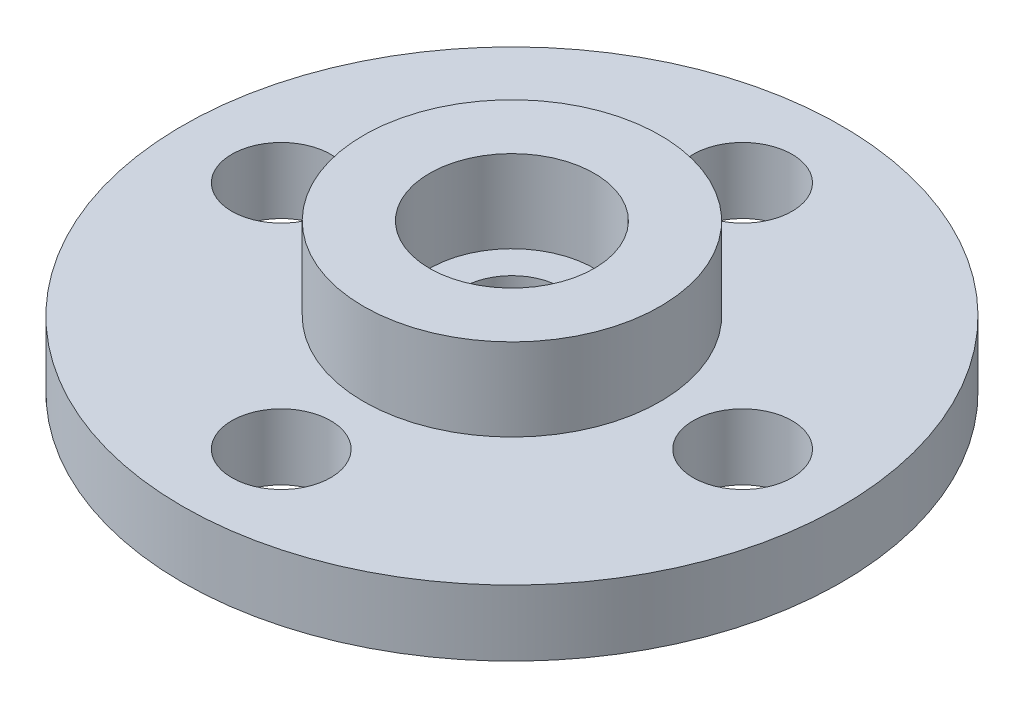
ISO-10303-21;
HEADER;
FILE_DESCRIPTION(('STEP AP214'),'2;1');
FILE_NAME('part.step','',(''),(''),'','','');
FILE_SCHEMA(('AUTOMOTIVE_DESIGN { 1 0 10303 214 1 1 1 1 }'));
ENDSEC;
DATA;
#1=APPLICATION_CONTEXT('core data for automotive mechanical design processes');
#2=APPLICATION_PROTOCOL_DEFINITION('international standard','automotive_design',2000,#1);
#3=PRODUCT_CONTEXT('',#1,'mechanical');
#4=PRODUCT('Part','Part','',(#3));
#5=PRODUCT_RELATED_PRODUCT_CATEGORY('part','',(#4));
#6=PRODUCT_DEFINITION_FORMATION('','',#4);
#7=PRODUCT_DEFINITION_CONTEXT('part definition',#1,'design');
#8=PRODUCT_DEFINITION('design','',#6,#7);
#9=PRODUCT_DEFINITION_SHAPE('','',#8);
#10=(LENGTH_UNIT() NAMED_UNIT(*) SI_UNIT(.MILLI.,.METRE.));
#11=(NAMED_UNIT(*) PLANE_ANGLE_UNIT() SI_UNIT($,.RADIAN.));
#12=(NAMED_UNIT(*) SI_UNIT($,.STERADIAN.) SOLID_ANGLE_UNIT());
#13=UNCERTAINTY_MEASURE_WITH_UNIT(LENGTH_MEASURE(1.E-05),#10,'distance_accuracy_value','');
#14=(GEOMETRIC_REPRESENTATION_CONTEXT(3) GLOBAL_UNCERTAINTY_ASSIGNED_CONTEXT((#13)) GLOBAL_UNIT_ASSIGNED_CONTEXT((#10,
#11,#12)) REPRESENTATION_CONTEXT('',''));
#15=CARTESIAN_POINT('',(0.,0.,0.));
#16=DIRECTION('',(0.,0.,1.));
#17=DIRECTION('',(1.,0.,0.));
#18=AXIS2_PLACEMENT_3D('',#15,#16,#17);
#19=CARTESIAN_POINT('',(0.,2.,0.));
#20=DIRECTION('',(0.,1.,0.));
#21=DIRECTION('',(0.,0.,1.));
#22=AXIS2_PLACEMENT_3D('',#19,#20,#21);
#23=PLANE('',#22);
#24=CARTESIAN_POINT('',(0.,2.,0.));
#25=DIRECTION('',(0.,1.,0.));
#26=DIRECTION('',(0.,0.,1.));
#27=AXIS2_PLACEMENT_3D('',#24,#25,#26);
#28=CIRCLE('',#27,1.5);
#29=CARTESIAN_POINT('',(0.,2.,1.5));
#30=VERTEX_POINT('',#29);
#31=EDGE_CURVE('E54',#30,#30,#28,.T.);
#32=ORIENTED_EDGE('',*,*,#31,.F.);
#33=EDGE_LOOP('',(#32));
#34=FACE_BOUND('',#33,.T.);
#35=CARTESIAN_POINT('',(0.,2.,0.));
#36=DIRECTION('',(0.,1.,0.));
#37=DIRECTION('',(0.,0.,1.));
#38=AXIS2_PLACEMENT_3D('',#35,#36,#37);
#39=CIRCLE('',#38,2.5);
#40=CARTESIAN_POINT('',(0.,2.,2.5));
#41=VERTEX_POINT('',#40);
#42=EDGE_CURVE('E10',#41,#41,#39,.F.);
#43=ORIENTED_EDGE('',*,*,#42,.F.);
#44=EDGE_LOOP('',(#43));
#45=FACE_BOUND('',#44,.T.);
#46=ADVANCED_FACE('F36',(#34,#45),#23,.T.);
#47=CARTESIAN_POINT('',(0.,2.,0.));
#48=DIRECTION('',(0.,-1.,0.));
#49=DIRECTION('',(0.,0.,-1.));
#50=AXIS2_PLACEMENT_3D('',#47,#48,#49);
#51=CYLINDRICAL_SURFACE('',#50,10.);
#52=CARTESIAN_POINT('',(0.,2.,0.));
#53=DIRECTION('',(0.,1.,0.));
#54=DIRECTION('',(0.,0.,1.));
#55=AXIS2_PLACEMENT_3D('',#52,#53,#54);
#56=CIRCLE('',#55,10.);
#57=CARTESIAN_POINT('',(0.,2.,10.));
#58=VERTEX_POINT('',#57);
#59=EDGE_CURVE('E43',#58,#58,#56,.T.);
#60=ORIENTED_EDGE('',*,*,#59,.F.);
#61=EDGE_LOOP('',(#60));
#62=FACE_BOUND('',#61,.T.);
#63=CARTESIAN_POINT('',(0.,0.,0.));
#64=DIRECTION('',(0.,1.,0.));
#65=DIRECTION('',(0.,0.,1.));
#66=AXIS2_PLACEMENT_3D('',#63,#64,#65);
#67=CIRCLE('',#66,10.);
#68=CARTESIAN_POINT('',(0.,0.,10.));
#69=VERTEX_POINT('',#68);
#70=EDGE_CURVE('E47',#69,#69,#67,.T.);
#71=ORIENTED_EDGE('',*,*,#70,.T.);
#72=EDGE_LOOP('',(#71));
#73=FACE_BOUND('',#72,.T.);
#74=ADVANCED_FACE('F38',(#62,#73),#51,.T.);
#75=CARTESIAN_POINT('',(0.,2.,0.));
#76=DIRECTION('',(0.,1.,0.));
#77=DIRECTION('',(0.,0.,1.));
#78=AXIS2_PLACEMENT_3D('',#75,#76,#77);
#79=CIRCLE('',#78,4.5);
#80=CARTESIAN_POINT('',(0.,2.,4.5));
#81=VERTEX_POINT('',#80);
#82=EDGE_CURVE('E84',#81,#81,#79,.T.);
#83=ORIENTED_EDGE('',*,*,#82,.F.);
#84=EDGE_LOOP('',(#83));
#85=FACE_BOUND('',#84,.T.);
#86=CARTESIAN_POINT('',(-7.,2.,0.));
#87=DIRECTION('',(0.,1.,0.));
#88=DIRECTION('',(0.,0.,1.));
#89=AXIS2_PLACEMENT_3D('',#86,#87,#88);
#90=CIRCLE('',#89,1.5);
#91=CARTESIAN_POINT('',(-7.,2.,1.5));
#92=VERTEX_POINT('',#91);
#93=EDGE_CURVE('E72',#92,#92,#90,.T.);
#94=ORIENTED_EDGE('',*,*,#93,.F.);
#95=EDGE_LOOP('',(#94));
#96=FACE_BOUND('',#95,.T.);
#97=CARTESIAN_POINT('',(0.,2.,7.));
#98=DIRECTION('',(0.,1.,0.));
#99=DIRECTION('',(0.,0.,1.));
#100=AXIS2_PLACEMENT_3D('',#97,#98,#99);
#101=CIRCLE('',#100,1.5);
#102=CARTESIAN_POINT('',(0.,2.,8.5));
#103=VERTEX_POINT('',#102);
#104=EDGE_CURVE('E79',#103,#103,#101,.T.);
#105=ORIENTED_EDGE('',*,*,#104,.F.);
#106=EDGE_LOOP('',(#105));
#107=FACE_BOUND('',#106,.T.);
#108=CARTESIAN_POINT('',(7.,2.,0.));
#109=DIRECTION('',(0.,1.,0.));
#110=DIRECTION('',(0.,0.,1.));
#111=AXIS2_PLACEMENT_3D('',#108,#109,#110);
#112=CIRCLE('',#111,1.5);
#113=CARTESIAN_POINT('',(7.,2.,1.5));
#114=VERTEX_POINT('',#113);
#115=EDGE_CURVE('E60',#114,#114,#112,.T.);
#116=ORIENTED_EDGE('',*,*,#115,.F.);
#117=EDGE_LOOP('',(#116));
#118=FACE_BOUND('',#117,.T.);
#119=CARTESIAN_POINT('',(0.,2.,-7.));
#120=DIRECTION('',(0.,1.,0.));
#121=DIRECTION('',(0.,0.,1.));
#122=AXIS2_PLACEMENT_3D('',#119,#120,#121);
#123=CIRCLE('',#122,1.5);
#124=CARTESIAN_POINT('',(0.,2.,-5.5));
#125=VERTEX_POINT('',#124);
#126=EDGE_CURVE('E67',#125,#125,#123,.T.);
#127=ORIENTED_EDGE('',*,*,#126,.F.);
#128=EDGE_LOOP('',(#127));
#129=FACE_BOUND('',#128,.T.);
#130=ORIENTED_EDGE('',*,*,#59,.T.);
#131=EDGE_LOOP('',(#130));
#132=FACE_BOUND('',#131,.T.);
#133=ADVANCED_FACE('F114',(#85,#96,#107,#118,#129,#132),#23,.T.);
#134=CARTESIAN_POINT('',(0.,0.,0.));
#135=DIRECTION('',(0.,1.,0.));
#136=DIRECTION('',(0.,0.,1.));
#137=AXIS2_PLACEMENT_3D('',#134,#135,#136);
#138=PLANE('',#137);
#139=CARTESIAN_POINT('',(-7.,0.,0.));
#140=DIRECTION('',(0.,1.,0.));
#141=DIRECTION('',(0.,0.,1.));
#142=AXIS2_PLACEMENT_3D('',#139,#140,#141);
#143=CIRCLE('',#142,1.5);
#144=CARTESIAN_POINT('',(-7.,0.,1.5));
#145=VERTEX_POINT('',#144);
#146=EDGE_CURVE('E75',#145,#145,#143,.T.);
#147=ORIENTED_EDGE('',*,*,#146,.T.);
#148=EDGE_LOOP('',(#147));
#149=FACE_BOUND('',#148,.T.);
#150=CARTESIAN_POINT('',(0.,0.,7.));
#151=DIRECTION('',(0.,1.,0.));
#152=DIRECTION('',(0.,0.,1.));
#153=AXIS2_PLACEMENT_3D('',#150,#151,#152);
#154=CIRCLE('',#153,1.5);
#155=CARTESIAN_POINT('',(0.,0.,8.5));
#156=VERTEX_POINT('',#155);
#157=EDGE_CURVE('E64',#156,#156,#154,.T.);
#158=ORIENTED_EDGE('',*,*,#157,.T.);
#159=EDGE_LOOP('',(#158));
#160=FACE_BOUND('',#159,.T.);
#161=CARTESIAN_POINT('',(7.,0.,0.));
#162=DIRECTION('',(0.,1.,0.));
#163=DIRECTION('',(0.,0.,1.));
#164=AXIS2_PLACEMENT_3D('',#161,#162,#163);
#165=CIRCLE('',#164,1.5);
#166=CARTESIAN_POINT('',(7.,0.,1.5));
#167=VERTEX_POINT('',#166);
#168=EDGE_CURVE('E63',#167,#167,#165,.T.);
#169=ORIENTED_EDGE('',*,*,#168,.T.);
#170=EDGE_LOOP('',(#169));
#171=FACE_BOUND('',#170,.T.);
#172=CARTESIAN_POINT('',(0.,0.,-7.));
#173=DIRECTION('',(0.,1.,0.));
#174=DIRECTION('',(0.,0.,1.));
#175=AXIS2_PLACEMENT_3D('',#172,#173,#174);
#176=CIRCLE('',#175,1.5);
#177=CARTESIAN_POINT('',(0.,0.,-5.5));
#178=VERTEX_POINT('',#177);
#179=EDGE_CURVE('E57',#178,#178,#176,.T.);
#180=ORIENTED_EDGE('',*,*,#179,.T.);
#181=EDGE_LOOP('',(#180));
#182=FACE_BOUND('',#181,.T.);
#183=CARTESIAN_POINT('',(0.,0.,0.));
#184=DIRECTION('',(0.,1.,0.));
#185=DIRECTION('',(0.,0.,1.));
#186=AXIS2_PLACEMENT_3D('',#183,#184,#185);
#187=CIRCLE('',#186,1.5);
#188=CARTESIAN_POINT('',(0.,0.,1.5));
#189=VERTEX_POINT('',#188);
#190=EDGE_CURVE('E52',#189,#189,#187,.T.);
#191=ORIENTED_EDGE('',*,*,#190,.T.);
#192=EDGE_LOOP('',(#191));
#193=FACE_BOUND('',#192,.T.);
#194=ORIENTED_EDGE('',*,*,#70,.F.);
#195=EDGE_LOOP('',(#194));
#196=FACE_BOUND('',#195,.T.);
#197=ADVANCED_FACE('F123',(#149,#160,#171,#182,#193,#196),#138,.F.);
#198=CARTESIAN_POINT('',(0.,0.,0.));
#199=DIRECTION('',(0.,1.,0.));
#200=DIRECTION('',(0.,0.,1.));
#201=AXIS2_PLACEMENT_3D('',#198,#199,#200);
#202=CYLINDRICAL_SURFACE('',#201,1.5);
#203=ORIENTED_EDGE('',*,*,#190,.F.);
#204=EDGE_LOOP('',(#203));
#205=FACE_BOUND('',#204,.T.);
#206=ORIENTED_EDGE('',*,*,#31,.T.);
#207=EDGE_LOOP('',(#206));
#208=FACE_BOUND('',#207,.T.);
#209=ADVANCED_FACE('F128',(#205,#208),#202,.F.);
#210=CARTESIAN_POINT('',(0.,0.,-7.));
#211=DIRECTION('',(0.,1.,0.));
#212=DIRECTION('',(0.,0.,1.));
#213=AXIS2_PLACEMENT_3D('',#210,#211,#212);
#214=CYLINDRICAL_SURFACE('',#213,1.5);
#215=ORIENTED_EDGE('',*,*,#179,.F.);
#216=EDGE_LOOP('',(#215));
#217=FACE_BOUND('',#216,.T.);
#218=ORIENTED_EDGE('',*,*,#126,.T.);
#219=EDGE_LOOP('',(#218));
#220=FACE_BOUND('',#219,.T.);
#221=ADVANCED_FACE('F140',(#217,#220),#214,.F.);
#222=CARTESIAN_POINT('',(7.,0.,0.));
#223=DIRECTION('',(0.,1.,0.));
#224=DIRECTION('',(0.,0.,1.));
#225=AXIS2_PLACEMENT_3D('',#222,#223,#224);
#226=CYLINDRICAL_SURFACE('',#225,1.5);
#227=ORIENTED_EDGE('',*,*,#168,.F.);
#228=EDGE_LOOP('',(#227));
#229=FACE_BOUND('',#228,.T.);
#230=ORIENTED_EDGE('',*,*,#115,.T.);
#231=EDGE_LOOP('',(#230));
#232=FACE_BOUND('',#231,.T.);
#233=ADVANCED_FACE('F142',(#229,#232),#226,.F.);
#234=CARTESIAN_POINT('',(0.,0.,7.));
#235=DIRECTION('',(0.,1.,0.));
#236=DIRECTION('',(0.,0.,1.));
#237=AXIS2_PLACEMENT_3D('',#234,#235,#236);
#238=CYLINDRICAL_SURFACE('',#237,1.5);
#239=ORIENTED_EDGE('',*,*,#157,.F.);
#240=EDGE_LOOP('',(#239));
#241=FACE_BOUND('',#240,.T.);
#242=ORIENTED_EDGE('',*,*,#104,.T.);
#243=EDGE_LOOP('',(#242));
#244=FACE_BOUND('',#243,.T.);
#245=ADVANCED_FACE('F107',(#241,#244),#238,.F.);
#246=CARTESIAN_POINT('',(-7.,0.,0.));
#247=DIRECTION('',(0.,1.,0.));
#248=DIRECTION('',(0.,0.,1.));
#249=AXIS2_PLACEMENT_3D('',#246,#247,#248);
#250=CYLINDRICAL_SURFACE('',#249,1.5);
#251=ORIENTED_EDGE('',*,*,#146,.F.);
#252=EDGE_LOOP('',(#251));
#253=FACE_BOUND('',#252,.T.);
#254=ORIENTED_EDGE('',*,*,#93,.T.);
#255=EDGE_LOOP('',(#254));
#256=FACE_BOUND('',#255,.T.);
#257=ADVANCED_FACE('F98',(#253,#256),#250,.F.);
#258=CARTESIAN_POINT('',(0.,4.5,0.));
#259=DIRECTION('',(0.,1.,0.));
#260=DIRECTION('',(0.,0.,1.));
#261=AXIS2_PLACEMENT_3D('',#258,#259,#260);
#262=PLANE('',#261);
#263=CARTESIAN_POINT('',(0.,4.5,0.));
#264=DIRECTION('',(0.,1.,0.));
#265=DIRECTION('',(0.,0.,1.));
#266=AXIS2_PLACEMENT_3D('',#263,#264,#265);
#267=CIRCLE('',#266,4.5);
#268=CARTESIAN_POINT('',(0.,4.5,4.5));
#269=VERTEX_POINT('',#268);
#270=EDGE_CURVE('E76',#269,#269,#267,.T.);
#271=ORIENTED_EDGE('',*,*,#270,.T.);
#272=EDGE_LOOP('',(#271));
#273=FACE_BOUND('',#272,.T.);
#274=CARTESIAN_POINT('',(0.,4.5,0.));
#275=DIRECTION('',(0.,1.,0.));
#276=DIRECTION('',(0.,0.,1.));
#277=AXIS2_PLACEMENT_3D('',#274,#275,#276);
#278=CIRCLE('',#277,2.5);
#279=CARTESIAN_POINT('',(0.,4.5,2.5));
#280=VERTEX_POINT('',#279);
#281=EDGE_CURVE('E87',#280,#280,#278,.T.);
#282=ORIENTED_EDGE('',*,*,#281,.F.);
#283=EDGE_LOOP('',(#282));
#284=FACE_BOUND('',#283,.T.);
#285=ADVANCED_FACE('F95',(#273,#284),#262,.T.);
#286=CARTESIAN_POINT('',(0.,4.5,0.));
#287=DIRECTION('',(0.,-1.,0.));
#288=DIRECTION('',(0.,0.,-1.));
#289=AXIS2_PLACEMENT_3D('',#286,#287,#288);
#290=CYLINDRICAL_SURFACE('',#289,4.5);
#291=ORIENTED_EDGE('',*,*,#270,.F.);
#292=EDGE_LOOP('',(#291));
#293=FACE_BOUND('',#292,.T.);
#294=ORIENTED_EDGE('',*,*,#82,.T.);
#295=EDGE_LOOP('',(#294));
#296=FACE_BOUND('',#295,.T.);
#297=ADVANCED_FACE('F97',(#293,#296),#290,.T.);
#298=CARTESIAN_POINT('',(0.,4.5,0.));
#299=DIRECTION('',(0.,-1.,0.));
#300=DIRECTION('',(0.,0.,-1.));
#301=AXIS2_PLACEMENT_3D('',#298,#299,#300);
#302=CYLINDRICAL_SURFACE('',#301,2.5);
#303=ORIENTED_EDGE('',*,*,#281,.T.);
#304=EDGE_LOOP('',(#303));
#305=FACE_BOUND('',#304,.T.);
#306=ORIENTED_EDGE('',*,*,#42,.T.);
#307=EDGE_LOOP('',(#306));
#308=FACE_BOUND('',#307,.T.);
#309=ADVANCED_FACE('F93',(#305,#308),#302,.F.);
#310=CLOSED_SHELL('',(#46,#74,#133,#197,#209,#221,#233,#245,#257,#285,#297,#309));
#311=MANIFOLD_SOLID_BREP('B2',#310);
#312=ADVANCED_BREP_SHAPE_REPRESENTATION('',(#18,#311),#14);
#313=SHAPE_DEFINITION_REPRESENTATION(#9,#312);
ENDSEC;
END-ISO-10303-21;
